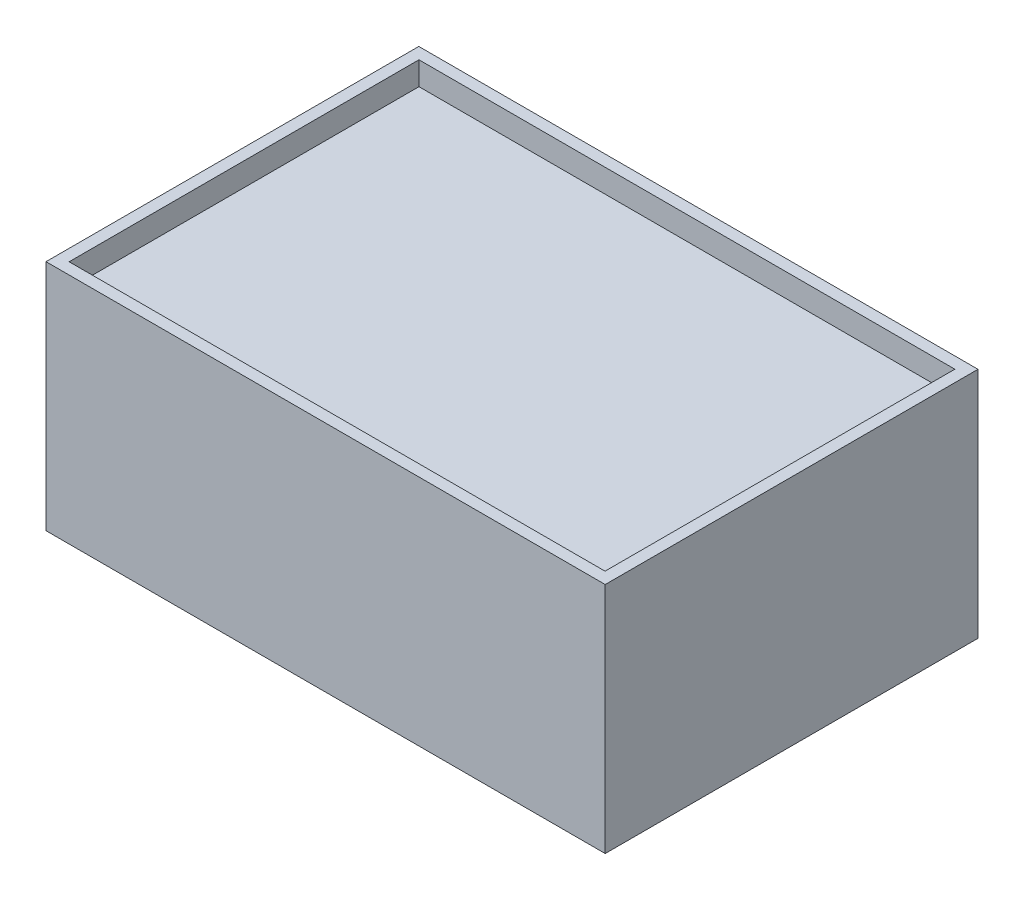
ISO-10303-21;
HEADER;
FILE_DESCRIPTION(('STEP AP214'),'2;1');
FILE_NAME('part.step','',(''),(''),'','','');
FILE_SCHEMA(('AUTOMOTIVE_DESIGN { 1 0 10303 214 1 1 1 1 }'));
ENDSEC;
DATA;
#1=APPLICATION_CONTEXT('core data for automotive mechanical design processes');
#2=APPLICATION_PROTOCOL_DEFINITION('international standard','automotive_design',2000,#1);
#3=PRODUCT_CONTEXT('',#1,'mechanical');
#4=PRODUCT('Part','Part','',(#3));
#5=PRODUCT_RELATED_PRODUCT_CATEGORY('part','',(#4));
#6=PRODUCT_DEFINITION_FORMATION('','',#4);
#7=PRODUCT_DEFINITION_CONTEXT('part definition',#1,'design');
#8=PRODUCT_DEFINITION('design','',#6,#7);
#9=PRODUCT_DEFINITION_SHAPE('','',#8);
#10=(LENGTH_UNIT() NAMED_UNIT(*) SI_UNIT(.MILLI.,.METRE.));
#11=(NAMED_UNIT(*) PLANE_ANGLE_UNIT() SI_UNIT($,.RADIAN.));
#12=(NAMED_UNIT(*) SI_UNIT($,.STERADIAN.) SOLID_ANGLE_UNIT());
#13=UNCERTAINTY_MEASURE_WITH_UNIT(LENGTH_MEASURE(1.E-05),#10,'distance_accuracy_value','');
#14=(GEOMETRIC_REPRESENTATION_CONTEXT(3) GLOBAL_UNCERTAINTY_ASSIGNED_CONTEXT((#13)) GLOBAL_UNIT_ASSIGNED_CONTEXT((#10,
#11,#12)) REPRESENTATION_CONTEXT('',''));
#15=CARTESIAN_POINT('',(0.,0.,0.));
#16=DIRECTION('',(0.,0.,1.));
#17=DIRECTION('',(1.,0.,0.));
#18=AXIS2_PLACEMENT_3D('',#15,#16,#17);
#19=CARTESIAN_POINT('',(-76.2,-31.75,-101.6));
#20=DIRECTION('',(0.,-1.,0.));
#21=DIRECTION('',(0.,0.,-1.));
#22=AXIS2_PLACEMENT_3D('',#19,#20,#21);
#23=PLANE('',#22);
#24=DIRECTION('',(1.,0.,0.));
#25=VECTOR('',#24,1.);
#26=CARTESIAN_POINT('',(-76.2,-31.75,0.));
#27=LINE('',#26,#25);
#28=CARTESIAN_POINT('',(-76.2,-31.75,0.));
#29=VERTEX_POINT('',#28);
#30=CARTESIAN_POINT('',(76.2,-31.75,0.));
#31=VERTEX_POINT('',#30);
#32=EDGE_CURVE('E196',#29,#31,#27,.T.);
#33=ORIENTED_EDGE('',*,*,#32,.F.);
#34=DIRECTION('',(0.,0.,1.));
#35=VECTOR('',#34,1.);
#36=CARTESIAN_POINT('',(-76.2,-31.75,-101.6));
#37=LINE('',#36,#35);
#38=CARTESIAN_POINT('',(-76.2,-31.75,-101.6));
#39=VERTEX_POINT('',#38);
#40=EDGE_CURVE('E42',#39,#29,#37,.T.);
#41=ORIENTED_EDGE('',*,*,#40,.F.);
#42=DIRECTION('',(1.,0.,0.));
#43=VECTOR('',#42,1.);
#44=CARTESIAN_POINT('',(-76.2,-31.75,-101.6));
#45=LINE('',#44,#43);
#46=CARTESIAN_POINT('',(76.2,-31.75,-101.6));
#47=VERTEX_POINT('',#46);
#48=EDGE_CURVE('E202',#39,#47,#45,.T.);
#49=ORIENTED_EDGE('',*,*,#48,.T.);
#50=DIRECTION('',(0.,0.,1.));
#51=VECTOR('',#50,1.);
#52=CARTESIAN_POINT('',(76.2,-31.75,-101.6));
#53=LINE('',#52,#51);
#54=EDGE_CURVE('E11',#47,#31,#53,.T.);
#55=ORIENTED_EDGE('',*,*,#54,.T.);
#56=EDGE_LOOP('',(#33,#41,#49,#55));
#57=FACE_BOUND('',#56,.T.);
#58=DIRECTION('',(-1.,0.,0.));
#59=VECTOR('',#58,1.);
#60=CARTESIAN_POINT('',(-73.025,-31.75,-98.47));
#61=LINE('',#60,#59);
#62=CARTESIAN_POINT('',(73.025,-31.75,-98.47));
#63=VERTEX_POINT('',#62);
#64=CARTESIAN_POINT('',(-73.025,-31.75,-98.47));
#65=VERTEX_POINT('',#64);
#66=EDGE_CURVE('E152',#63,#65,#61,.T.);
#67=ORIENTED_EDGE('',*,*,#66,.T.);
#68=DIRECTION('',(0.,0.,1.));
#69=VECTOR('',#68,1.);
#70=CARTESIAN_POINT('',(-73.025,-31.75,-98.47));
#71=LINE('',#70,#69);
#72=CARTESIAN_POINT('',(-73.025,-31.75,-3.12999999999999));
#73=VERTEX_POINT('',#72);
#74=EDGE_CURVE('E50',#65,#73,#71,.T.);
#75=ORIENTED_EDGE('',*,*,#74,.T.);
#76=DIRECTION('',(1.,0.,0.));
#77=VECTOR('',#76,1.);
#78=CARTESIAN_POINT('',(-73.025,-31.75,-3.12999999999999));
#79=LINE('',#78,#77);
#80=CARTESIAN_POINT('',(73.025,-31.75,-3.12999999999998));
#81=VERTEX_POINT('',#80);
#82=EDGE_CURVE('E143',#73,#81,#79,.T.);
#83=ORIENTED_EDGE('',*,*,#82,.T.);
#84=DIRECTION('',(0.,0.,-1.));
#85=VECTOR('',#84,1.);
#86=CARTESIAN_POINT('',(73.025,-31.75,-98.47));
#87=LINE('',#86,#85);
#88=EDGE_CURVE('E146',#81,#63,#87,.T.);
#89=ORIENTED_EDGE('',*,*,#88,.T.);
#90=EDGE_LOOP('',(#67,#75,#83,#89));
#91=FACE_BOUND('',#90,.T.);
#92=ADVANCED_FACE('F33',(#57,#91),#23,.T.);
#93=CARTESIAN_POINT('',(76.2,31.75,-101.6));
#94=DIRECTION('',(1.,0.,0.));
#95=DIRECTION('',(0.,1.,0.));
#96=AXIS2_PLACEMENT_3D('',#93,#94,#95);
#97=PLANE('',#96);
#98=DIRECTION('',(0.,1.,0.));
#99=VECTOR('',#98,1.);
#100=CARTESIAN_POINT('',(76.2,31.75,0.));
#101=LINE('',#100,#99);
#102=CARTESIAN_POINT('',(76.2,31.75,0.));
#103=VERTEX_POINT('',#102);
#104=EDGE_CURVE('E186',#31,#103,#101,.T.);
#105=ORIENTED_EDGE('',*,*,#104,.F.);
#106=ORIENTED_EDGE('',*,*,#54,.F.);
#107=DIRECTION('',(0.,1.,0.));
#108=VECTOR('',#107,1.);
#109=CARTESIAN_POINT('',(76.2,31.75,-101.6));
#110=LINE('',#109,#108);
#111=CARTESIAN_POINT('',(76.2,31.75,-101.6));
#112=VERTEX_POINT('',#111);
#113=EDGE_CURVE('E192',#47,#112,#110,.T.);
#114=ORIENTED_EDGE('',*,*,#113,.T.);
#115=DIRECTION('',(0.,0.,1.));
#116=VECTOR('',#115,1.);
#117=CARTESIAN_POINT('',(76.2,31.75,-101.6));
#118=LINE('',#117,#116);
#119=EDGE_CURVE('E37',#112,#103,#118,.T.);
#120=ORIENTED_EDGE('',*,*,#119,.T.);
#121=EDGE_LOOP('',(#105,#106,#114,#120));
#122=FACE_BOUND('',#121,.T.);
#123=ADVANCED_FACE('F35',(#122),#97,.T.);
#124=CARTESIAN_POINT('',(-76.2,31.75,-101.6));
#125=DIRECTION('',(-1.,0.,0.));
#126=DIRECTION('',(0.,0.,1.));
#127=AXIS2_PLACEMENT_3D('',#124,#125,#126);
#128=PLANE('',#127);
#129=DIRECTION('',(0.,-1.,0.));
#130=VECTOR('',#129,1.);
#131=CARTESIAN_POINT('',(-76.2,31.75,0.));
#132=LINE('',#131,#130);
#133=CARTESIAN_POINT('',(-76.2,31.75,0.));
#134=VERTEX_POINT('',#133);
#135=EDGE_CURVE('E210',#134,#29,#132,.T.);
#136=ORIENTED_EDGE('',*,*,#135,.F.);
#137=DIRECTION('',(0.,0.,1.));
#138=VECTOR('',#137,1.);
#139=CARTESIAN_POINT('',(-76.2,31.75,-101.6));
#140=LINE('',#139,#138);
#141=CARTESIAN_POINT('',(-76.2,31.75,-101.6));
#142=VERTEX_POINT('',#141);
#143=EDGE_CURVE('E215',#142,#134,#140,.T.);
#144=ORIENTED_EDGE('',*,*,#143,.F.);
#145=DIRECTION('',(0.,-1.,0.));
#146=VECTOR('',#145,1.);
#147=CARTESIAN_POINT('',(-76.2,31.75,-101.6));
#148=LINE('',#147,#146);
#149=EDGE_CURVE('E199',#142,#39,#148,.T.);
#150=ORIENTED_EDGE('',*,*,#149,.T.);
#151=ORIENTED_EDGE('',*,*,#40,.T.);
#152=EDGE_LOOP('',(#136,#144,#150,#151));
#153=FACE_BOUND('',#152,.T.);
#154=ADVANCED_FACE('F234',(#153),#128,.T.);
#155=CARTESIAN_POINT('',(-76.2,31.75,-101.6));
#156=DIRECTION('',(0.,1.,0.));
#157=DIRECTION('',(0.,0.,1.));
#158=AXIS2_PLACEMENT_3D('',#155,#156,#157);
#159=PLANE('',#158);
#160=DIRECTION('',(0.,0.,1.));
#161=VECTOR('',#160,1.);
#162=CARTESIAN_POINT('',(-73.025,31.75,-98.47));
#163=LINE('',#162,#161);
#164=CARTESIAN_POINT('',(-73.025,31.75,-98.47));
#165=VERTEX_POINT('',#164);
#166=CARTESIAN_POINT('',(-73.025,31.75,-3.12999999999999));
#167=VERTEX_POINT('',#166);
#168=EDGE_CURVE('E58',#165,#167,#163,.T.);
#169=ORIENTED_EDGE('',*,*,#168,.F.);
#170=DIRECTION('',(-1.,0.,0.));
#171=VECTOR('',#170,1.);
#172=CARTESIAN_POINT('',(-73.025,31.75,-98.47));
#173=LINE('',#172,#171);
#174=CARTESIAN_POINT('',(73.025,31.75,-98.47));
#175=VERTEX_POINT('',#174);
#176=EDGE_CURVE('E165',#175,#165,#173,.T.);
#177=ORIENTED_EDGE('',*,*,#176,.F.);
#178=DIRECTION('',(0.,0.,-1.));
#179=VECTOR('',#178,1.);
#180=CARTESIAN_POINT('',(73.025,31.75,-98.47));
#181=LINE('',#180,#179);
#182=CARTESIAN_POINT('',(73.025,31.75,-3.12999999999998));
#183=VERTEX_POINT('',#182);
#184=EDGE_CURVE('E179',#183,#175,#181,.T.);
#185=ORIENTED_EDGE('',*,*,#184,.F.);
#186=DIRECTION('',(1.,0.,0.));
#187=VECTOR('',#186,1.);
#188=CARTESIAN_POINT('',(-73.025,31.75,-3.12999999999999));
#189=LINE('',#188,#187);
#190=EDGE_CURVE('E176',#167,#183,#189,.T.);
#191=ORIENTED_EDGE('',*,*,#190,.F.);
#192=EDGE_LOOP('',(#169,#177,#185,#191));
#193=FACE_BOUND('',#192,.T.);
#194=DIRECTION('',(-1.,0.,0.));
#195=VECTOR('',#194,1.);
#196=CARTESIAN_POINT('',(-76.2,31.75,0.));
#197=LINE('',#196,#195);
#198=EDGE_CURVE('E207',#103,#134,#197,.T.);
#199=ORIENTED_EDGE('',*,*,#198,.F.);
#200=ORIENTED_EDGE('',*,*,#119,.F.);
#201=DIRECTION('',(-1.,0.,0.));
#202=VECTOR('',#201,1.);
#203=CARTESIAN_POINT('',(-76.2,31.75,-101.6));
#204=LINE('',#203,#202);
#205=EDGE_CURVE('E195',#112,#142,#204,.T.);
#206=ORIENTED_EDGE('',*,*,#205,.T.);
#207=ORIENTED_EDGE('',*,*,#143,.T.);
#208=EDGE_LOOP('',(#199,#200,#206,#207));
#209=FACE_BOUND('',#208,.T.);
#210=ADVANCED_FACE('F223',(#193,#209),#159,.T.);
#211=CARTESIAN_POINT('',(0.,0.,-101.6));
#212=DIRECTION('',(0.,0.,1.));
#213=DIRECTION('',(1.,0.,0.));
#214=AXIS2_PLACEMENT_3D('',#211,#212,#213);
#215=PLANE('',#214);
#216=ORIENTED_EDGE('',*,*,#113,.F.);
#217=ORIENTED_EDGE('',*,*,#48,.F.);
#218=ORIENTED_EDGE('',*,*,#149,.F.);
#219=ORIENTED_EDGE('',*,*,#205,.F.);
#220=EDGE_LOOP('',(#216,#217,#218,#219));
#221=FACE_BOUND('',#220,.T.);
#222=ADVANCED_FACE('F231',(#221),#215,.F.);
#223=CARTESIAN_POINT('',(0.,0.,0.));
#224=DIRECTION('',(0.,0.,1.));
#225=DIRECTION('',(1.,0.,0.));
#226=AXIS2_PLACEMENT_3D('',#223,#224,#225);
#227=PLANE('',#226);
#228=ORIENTED_EDGE('',*,*,#104,.T.);
#229=ORIENTED_EDGE('',*,*,#198,.T.);
#230=ORIENTED_EDGE('',*,*,#135,.T.);
#231=ORIENTED_EDGE('',*,*,#32,.T.);
#232=EDGE_LOOP('',(#228,#229,#230,#231));
#233=FACE_BOUND('',#232,.T.);
#234=ADVANCED_FACE('F225',(#233),#227,.T.);
#235=CARTESIAN_POINT('',(-73.025,25.4,-98.47));
#236=DIRECTION('',(-1.,0.,0.));
#237=DIRECTION('',(0.,0.,1.));
#238=AXIS2_PLACEMENT_3D('',#235,#236,#237);
#239=PLANE('',#238);
#240=ORIENTED_EDGE('',*,*,#168,.T.);
#241=DIRECTION('',(0.,1.,0.));
#242=VECTOR('',#241,1.);
#243=CARTESIAN_POINT('',(-73.025,25.4,-3.12999999999999));
#244=LINE('',#243,#242);
#245=CARTESIAN_POINT('',(-73.025,25.4,-3.12999999999999));
#246=VERTEX_POINT('',#245);
#247=EDGE_CURVE('E174',#246,#167,#244,.T.);
#248=ORIENTED_EDGE('',*,*,#247,.F.);
#249=DIRECTION('',(0.,0.,1.));
#250=VECTOR('',#249,1.);
#251=CARTESIAN_POINT('',(-73.025,25.4,-98.47));
#252=LINE('',#251,#250);
#253=CARTESIAN_POINT('',(-73.025,25.4,-98.47));
#254=VERTEX_POINT('',#253);
#255=EDGE_CURVE('E161',#254,#246,#252,.T.);
#256=ORIENTED_EDGE('',*,*,#255,.F.);
#257=DIRECTION('',(0.,1.,0.));
#258=VECTOR('',#257,1.);
#259=CARTESIAN_POINT('',(-73.025,25.4,-98.47));
#260=LINE('',#259,#258);
#261=EDGE_CURVE('E184',#254,#165,#260,.T.);
#262=ORIENTED_EDGE('',*,*,#261,.T.);
#263=EDGE_LOOP('',(#240,#248,#256,#262));
#264=FACE_BOUND('',#263,.T.);
#265=ADVANCED_FACE('F249',(#264),#239,.F.);
#266=CARTESIAN_POINT('',(-73.025,25.4,-98.47));
#267=DIRECTION('',(0.,0.,-1.));
#268=DIRECTION('',(-1.,0.,0.));
#269=AXIS2_PLACEMENT_3D('',#266,#267,#268);
#270=PLANE('',#269);
#271=ORIENTED_EDGE('',*,*,#176,.T.);
#272=ORIENTED_EDGE('',*,*,#261,.F.);
#273=DIRECTION('',(-1.,0.,0.));
#274=VECTOR('',#273,1.);
#275=CARTESIAN_POINT('',(-73.025,25.4,-98.47));
#276=LINE('',#275,#274);
#277=CARTESIAN_POINT('',(73.025,25.4,-98.47));
#278=VERTEX_POINT('',#277);
#279=EDGE_CURVE('E171',#278,#254,#276,.T.);
#280=ORIENTED_EDGE('',*,*,#279,.F.);
#281=DIRECTION('',(0.,1.,0.));
#282=VECTOR('',#281,1.);
#283=CARTESIAN_POINT('',(73.025,25.4,-98.47));
#284=LINE('',#283,#282);
#285=EDGE_CURVE('E187',#278,#175,#284,.T.);
#286=ORIENTED_EDGE('',*,*,#285,.T.);
#287=EDGE_LOOP('',(#271,#272,#280,#286));
#288=FACE_BOUND('',#287,.T.);
#289=ADVANCED_FACE('F254',(#288),#270,.F.);
#290=CARTESIAN_POINT('',(73.025,25.4,-98.47));
#291=DIRECTION('',(1.,0.,0.));
#292=DIRECTION('',(0.,0.,-1.));
#293=AXIS2_PLACEMENT_3D('',#290,#291,#292);
#294=PLANE('',#293);
#295=ORIENTED_EDGE('',*,*,#184,.T.);
#296=ORIENTED_EDGE('',*,*,#285,.F.);
#297=DIRECTION('',(0.,0.,-1.));
#298=VECTOR('',#297,1.);
#299=CARTESIAN_POINT('',(73.025,25.4,-98.47));
#300=LINE('',#299,#298);
#301=CARTESIAN_POINT('',(73.025,25.4,-3.12999999999998));
#302=VERTEX_POINT('',#301);
#303=EDGE_CURVE('E168',#302,#278,#300,.T.);
#304=ORIENTED_EDGE('',*,*,#303,.F.);
#305=DIRECTION('',(0.,1.,0.));
#306=VECTOR('',#305,1.);
#307=CARTESIAN_POINT('',(73.025,25.4,-3.12999999999998));
#308=LINE('',#307,#306);
#309=EDGE_CURVE('E189',#302,#183,#308,.T.);
#310=ORIENTED_EDGE('',*,*,#309,.T.);
#311=EDGE_LOOP('',(#295,#296,#304,#310));
#312=FACE_BOUND('',#311,.T.);
#313=ADVANCED_FACE('F259',(#312),#294,.F.);
#314=CARTESIAN_POINT('',(-73.025,25.4,-3.12999999999999));
#315=DIRECTION('',(0.,0.,1.));
#316=DIRECTION('',(1.,0.,0.));
#317=AXIS2_PLACEMENT_3D('',#314,#315,#316);
#318=PLANE('',#317);
#319=ORIENTED_EDGE('',*,*,#190,.T.);
#320=ORIENTED_EDGE('',*,*,#309,.F.);
#321=DIRECTION('',(1.,0.,0.));
#322=VECTOR('',#321,1.);
#323=CARTESIAN_POINT('',(-73.025,25.4,-3.12999999999999));
#324=LINE('',#323,#322);
#325=EDGE_CURVE('E164',#246,#302,#324,.T.);
#326=ORIENTED_EDGE('',*,*,#325,.F.);
#327=ORIENTED_EDGE('',*,*,#247,.T.);
#328=EDGE_LOOP('',(#319,#320,#326,#327));
#329=FACE_BOUND('',#328,.T.);
#330=ADVANCED_FACE('F255',(#329),#318,.F.);
#331=CARTESIAN_POINT('',(0.,25.4,0.));
#332=DIRECTION('',(0.,1.,0.));
#333=DIRECTION('',(0.,0.,1.));
#334=AXIS2_PLACEMENT_3D('',#331,#332,#333);
#335=PLANE('',#334);
#336=ORIENTED_EDGE('',*,*,#255,.T.);
#337=ORIENTED_EDGE('',*,*,#325,.T.);
#338=ORIENTED_EDGE('',*,*,#303,.T.);
#339=ORIENTED_EDGE('',*,*,#279,.T.);
#340=EDGE_LOOP('',(#336,#337,#338,#339));
#341=FACE_BOUND('',#340,.T.);
#342=ADVANCED_FACE('F258',(#341),#335,.T.);
#343=CARTESIAN_POINT('',(-73.025,-25.4,-98.47));
#344=DIRECTION('',(1.,0.,0.));
#345=DIRECTION('',(0.,0.,-1.));
#346=AXIS2_PLACEMENT_3D('',#343,#344,#345);
#347=PLANE('',#346);
#348=ORIENTED_EDGE('',*,*,#74,.F.);
#349=DIRECTION('',(0.,-1.,0.));
#350=VECTOR('',#349,1.);
#351=CARTESIAN_POINT('',(-73.025,-25.4,-98.47));
#352=LINE('',#351,#350);
#353=CARTESIAN_POINT('',(-73.025,-25.4,-98.47));
#354=VERTEX_POINT('',#353);
#355=EDGE_CURVE('E128',#354,#65,#352,.T.);
#356=ORIENTED_EDGE('',*,*,#355,.F.);
#357=DIRECTION('',(0.,0.,1.));
#358=VECTOR('',#357,1.);
#359=CARTESIAN_POINT('',(-73.025,-25.4,-98.47));
#360=LINE('',#359,#358);
#361=CARTESIAN_POINT('',(-73.025,-25.4,-3.12999999999999));
#362=VERTEX_POINT('',#361);
#363=EDGE_CURVE('E135',#354,#362,#360,.T.);
#364=ORIENTED_EDGE('',*,*,#363,.T.);
#365=DIRECTION('',(0.,-1.,0.));
#366=VECTOR('',#365,1.);
#367=CARTESIAN_POINT('',(-73.025,-25.4,-3.12999999999999));
#368=LINE('',#367,#366);
#369=EDGE_CURVE('E156',#362,#73,#368,.T.);
#370=ORIENTED_EDGE('',*,*,#369,.T.);
#371=EDGE_LOOP('',(#348,#356,#364,#370));
#372=FACE_BOUND('',#371,.T.);
#373=ADVANCED_FACE('F138',(#372),#347,.T.);
#374=CARTESIAN_POINT('',(-73.025,-25.4,-3.12999999999999));
#375=DIRECTION('',(0.,0.,-1.));
#376=DIRECTION('',(-1.,0.,0.));
#377=AXIS2_PLACEMENT_3D('',#374,#375,#376);
#378=PLANE('',#377);
#379=ORIENTED_EDGE('',*,*,#82,.F.);
#380=ORIENTED_EDGE('',*,*,#369,.F.);
#381=DIRECTION('',(1.,0.,0.));
#382=VECTOR('',#381,1.);
#383=CARTESIAN_POINT('',(-73.025,-25.4,-3.12999999999999));
#384=LINE('',#383,#382);
#385=CARTESIAN_POINT('',(73.025,-25.4,-3.12999999999998));
#386=VERTEX_POINT('',#385);
#387=EDGE_CURVE('E140',#362,#386,#384,.T.);
#388=ORIENTED_EDGE('',*,*,#387,.T.);
#389=DIRECTION('',(0.,-1.,0.));
#390=VECTOR('',#389,1.);
#391=CARTESIAN_POINT('',(73.025,-25.4,-3.12999999999998));
#392=LINE('',#391,#390);
#393=EDGE_CURVE('E158',#386,#81,#392,.T.);
#394=ORIENTED_EDGE('',*,*,#393,.T.);
#395=EDGE_LOOP('',(#379,#380,#388,#394));
#396=FACE_BOUND('',#395,.T.);
#397=ADVANCED_FACE('F272',(#396),#378,.T.);
#398=CARTESIAN_POINT('',(73.025,-25.4,-98.47));
#399=DIRECTION('',(-1.,0.,0.));
#400=DIRECTION('',(0.,0.,1.));
#401=AXIS2_PLACEMENT_3D('',#398,#399,#400);
#402=PLANE('',#401);
#403=ORIENTED_EDGE('',*,*,#88,.F.);
#404=ORIENTED_EDGE('',*,*,#393,.F.);
#405=DIRECTION('',(0.,0.,-1.));
#406=VECTOR('',#405,1.);
#407=CARTESIAN_POINT('',(73.025,-25.4,-98.47));
#408=LINE('',#407,#406);
#409=CARTESIAN_POINT('',(73.025,-25.4,-98.47));
#410=VERTEX_POINT('',#409);
#411=EDGE_CURVE('E134',#386,#410,#408,.T.);
#412=ORIENTED_EDGE('',*,*,#411,.T.);
#413=DIRECTION('',(0.,-1.,0.));
#414=VECTOR('',#413,1.);
#415=CARTESIAN_POINT('',(73.025,-25.4,-98.47));
#416=LINE('',#415,#414);
#417=EDGE_CURVE('E130',#410,#63,#416,.T.);
#418=ORIENTED_EDGE('',*,*,#417,.T.);
#419=EDGE_LOOP('',(#403,#404,#412,#418));
#420=FACE_BOUND('',#419,.T.);
#421=ADVANCED_FACE('F275',(#420),#402,.T.);
#422=CARTESIAN_POINT('',(-73.025,-25.4,-98.47));
#423=DIRECTION('',(0.,0.,1.));
#424=DIRECTION('',(1.,0.,0.));
#425=AXIS2_PLACEMENT_3D('',#422,#423,#424);
#426=PLANE('',#425);
#427=ORIENTED_EDGE('',*,*,#66,.F.);
#428=ORIENTED_EDGE('',*,*,#417,.F.);
#429=DIRECTION('',(-1.,0.,0.));
#430=VECTOR('',#429,1.);
#431=CARTESIAN_POINT('',(-73.025,-25.4,-98.47));
#432=LINE('',#431,#430);
#433=EDGE_CURVE('E125',#410,#354,#432,.T.);
#434=ORIENTED_EDGE('',*,*,#433,.T.);
#435=ORIENTED_EDGE('',*,*,#355,.T.);
#436=EDGE_LOOP('',(#427,#428,#434,#435));
#437=FACE_BOUND('',#436,.T.);
#438=ADVANCED_FACE('F127',(#437),#426,.T.);
#439=CARTESIAN_POINT('',(0.,-25.4,0.));
#440=DIRECTION('',(0.,-1.,0.));
#441=DIRECTION('',(0.,0.,1.));
#442=AXIS2_PLACEMENT_3D('',#439,#440,#441);
#443=PLANE('',#442);
#444=ORIENTED_EDGE('',*,*,#363,.F.);
#445=ORIENTED_EDGE('',*,*,#433,.F.);
#446=ORIENTED_EDGE('',*,*,#411,.F.);
#447=ORIENTED_EDGE('',*,*,#387,.F.);
#448=EDGE_LOOP('',(#444,#445,#446,#447));
#449=FACE_BOUND('',#448,.T.);
#450=ADVANCED_FACE('F142',(#449),#443,.T.);
#451=CLOSED_SHELL('',(#92,#123,#154,#210,#222,#234,#265,#289,#313,#330,#342,#373,#397,#421,#438,#450));
#452=MANIFOLD_SOLID_BREP('B2',#451);
#453=ADVANCED_BREP_SHAPE_REPRESENTATION('',(#18,#452),#14);
#454=SHAPE_DEFINITION_REPRESENTATION(#9,#453);
ENDSEC;
END-ISO-10303-21;
